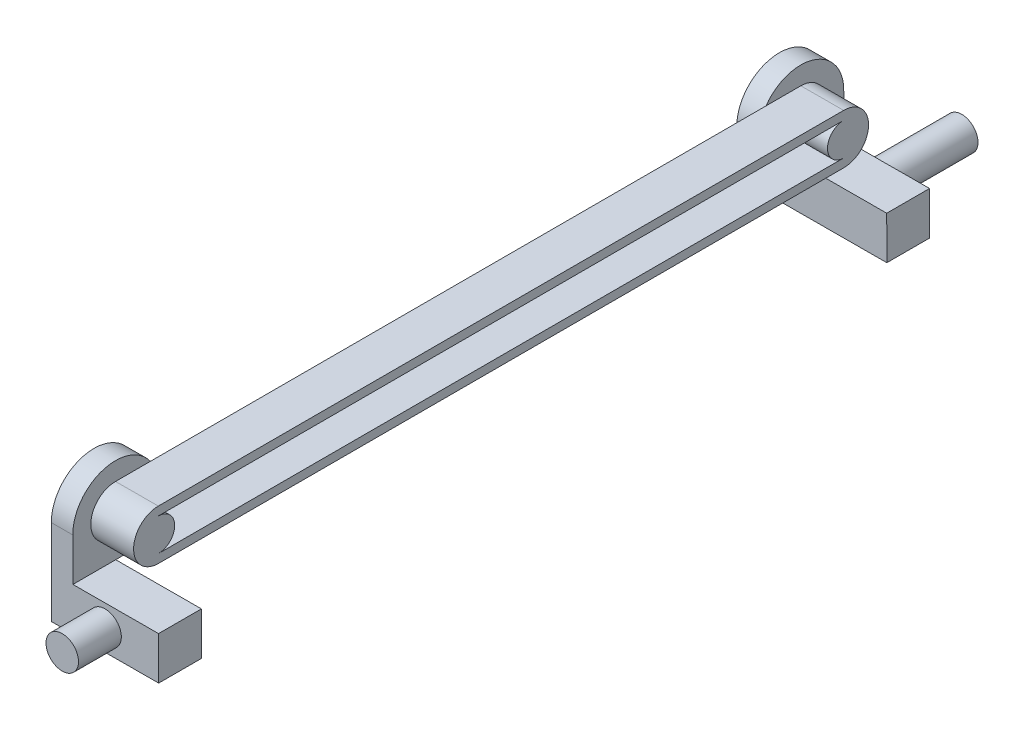
ISO-10303-21;
HEADER;
FILE_DESCRIPTION(('STEP AP214'),'2;1');
FILE_NAME('part.step','',(''),(''),'','','');
FILE_SCHEMA(('AUTOMOTIVE_DESIGN { 1 0 10303 214 1 1 1 1 }'));
ENDSEC;
DATA;
#1=APPLICATION_CONTEXT('core data for automotive mechanical design processes');
#2=APPLICATION_PROTOCOL_DEFINITION('international standard','automotive_design',2000,#1);
#3=PRODUCT_CONTEXT('',#1,'mechanical');
#4=PRODUCT('Part','Part','',(#3));
#5=PRODUCT_RELATED_PRODUCT_CATEGORY('part','',(#4));
#6=PRODUCT_DEFINITION_FORMATION('','',#4);
#7=PRODUCT_DEFINITION_CONTEXT('part definition',#1,'design');
#8=PRODUCT_DEFINITION('design','',#6,#7);
#9=PRODUCT_DEFINITION_SHAPE('','',#8);
#10=(LENGTH_UNIT() NAMED_UNIT(*) SI_UNIT(.MILLI.,.METRE.));
#11=(NAMED_UNIT(*) PLANE_ANGLE_UNIT() SI_UNIT($,.RADIAN.));
#12=(NAMED_UNIT(*) SI_UNIT($,.STERADIAN.) SOLID_ANGLE_UNIT());
#13=UNCERTAINTY_MEASURE_WITH_UNIT(LENGTH_MEASURE(1.E-05),#10,'distance_accuracy_value','');
#14=(GEOMETRIC_REPRESENTATION_CONTEXT(3) GLOBAL_UNCERTAINTY_ASSIGNED_CONTEXT((#13)) GLOBAL_UNIT_ASSIGNED_CONTEXT((#10,
#11,#12)) REPRESENTATION_CONTEXT('',''));
#15=CARTESIAN_POINT('',(0.,0.,0.));
#16=DIRECTION('',(0.,0.,1.));
#17=DIRECTION('',(1.,0.,0.));
#18=AXIS2_PLACEMENT_3D('',#15,#16,#17);
#19=CARTESIAN_POINT('',(342.212888015479,116.84018503398,190.));
#20=DIRECTION('',(0.999994749341557,0.00324056928889778,0.));
#21=DIRECTION('',(-0.00324056928889778,0.999994749341557,0.));
#22=AXIS2_PLACEMENT_3D('',#19,#20,#21);
#23=PLANE('',#22);
#24=DIRECTION('',(0.,0.,-1.));
#25=VECTOR('',#24,1.);
#26=CARTESIAN_POINT('',(342.245293878521,106.84018503398,190.));
#27=LINE('',#26,#25);
#28=CARTESIAN_POINT('',(342.245293878521,106.84018503398,20.));
#29=VERTEX_POINT('',#28);
#30=CARTESIAN_POINT('',(342.245293878521,106.84018503398,10.));
#31=VERTEX_POINT('',#30);
#32=EDGE_CURVE('E256',#29,#31,#27,.T.);
#33=ORIENTED_EDGE('',*,*,#32,.F.);
#34=DIRECTION('',(-0.00324056928889778,0.999994749341557,0.));
#35=VECTOR('',#34,1.);
#36=CARTESIAN_POINT('',(342.212888015479,116.84018503398,20.));
#37=LINE('',#36,#35);
#38=CARTESIAN_POINT('',(342.212888015479,116.84018503398,20.));
#39=VERTEX_POINT('',#38);
#40=EDGE_CURVE('E336',#29,#39,#37,.T.);
#41=ORIENTED_EDGE('',*,*,#40,.T.);
#42=DIRECTION('',(0.,0.,1.));
#43=VECTOR('',#42,1.);
#44=CARTESIAN_POINT('',(342.212888015479,116.84018503398,190.));
#45=LINE('',#44,#43);
#46=CARTESIAN_POINT('',(342.212888015479,116.84018503398,30.));
#47=VERTEX_POINT('',#46);
#48=EDGE_CURVE('E335',#39,#47,#45,.T.);
#49=ORIENTED_EDGE('',*,*,#48,.T.);
#50=DIRECTION('',(-0.00324056928889816,0.999994749341557,0.));
#51=VECTOR('',#50,1.);
#52=CARTESIAN_POINT('',(342.18048232259,126.840132527396,30.));
#53=LINE('',#52,#51);
#54=CARTESIAN_POINT('',(342.18048232259,126.840132527396,30.));
#55=VERTEX_POINT('',#54);
#56=EDGE_CURVE('E268',#47,#55,#53,.T.);
#57=ORIENTED_EDGE('',*,*,#56,.T.);
#58=CARTESIAN_POINT('',(342.18048232259,126.840132527396,20.));
#59=DIRECTION('',(-0.999994749341557,-0.00324056928889778,0.));
#60=DIRECTION('',(-0.00324056928889778,0.999994749341557,0.));
#61=AXIS2_PLACEMENT_3D('',#58,#59,#60);
#62=CIRCLE('',#61,10.);
#63=CARTESIAN_POINT('',(342.18048232259,126.840132527396,10.));
#64=VERTEX_POINT('',#63);
#65=EDGE_CURVE('E271',#55,#64,#62,.T.);
#66=ORIENTED_EDGE('',*,*,#65,.T.);
#67=DIRECTION('',(0.00324056928889778,-0.999994749341557,0.));
#68=VECTOR('',#67,1.);
#69=CARTESIAN_POINT('',(342.212888015479,116.84018503398,10.));
#70=LINE('',#69,#68);
#71=EDGE_CURVE('E288',#64,#31,#70,.T.);
#72=ORIENTED_EDGE('',*,*,#71,.T.);
#73=EDGE_LOOP('',(#33,#41,#49,#57,#66,#72));
#74=FACE_BOUND('',#73,.T.);
#75=ADVANCED_FACE('F34',(#74),#23,.F.);
#76=CARTESIAN_POINT('',(367.245293878521,106.921199691583,190.));
#77=DIRECTION('',(-0.00324056928889667,0.999994749341557,0.));
#78=DIRECTION('',(-0.999994749341557,-0.00324056928889667,0.));
#79=AXIS2_PLACEMENT_3D('',#76,#77,#78);
#80=PLANE('',#79);
#81=CARTESIAN_POINT('',(342.245293878521,106.84018503398,190.));
#82=VERTEX_POINT('',#81);
#83=CARTESIAN_POINT('',(342.245293878521,106.84018503398,180.));
#84=VERTEX_POINT('',#83);
#85=EDGE_CURVE('E257',#82,#84,#27,.T.);
#86=ORIENTED_EDGE('',*,*,#85,.T.);
#87=DIRECTION('',(0.999994749341557,0.00324056928889667,0.));
#88=VECTOR('',#87,1.);
#89=CARTESIAN_POINT('',(367.245293878521,106.921199691583,180.));
#90=LINE('',#89,#88);
#91=CARTESIAN_POINT('',(367.24529387852,106.921199691583,180.));
#92=VERTEX_POINT('',#91);
#93=EDGE_CURVE('E501',#84,#92,#90,.T.);
#94=ORIENTED_EDGE('',*,*,#93,.T.);
#95=DIRECTION('',(0.,0.,-1.));
#96=VECTOR('',#95,1.);
#97=CARTESIAN_POINT('',(367.245293878521,106.921199691583,190.));
#98=LINE('',#97,#96);
#99=CARTESIAN_POINT('',(367.245293878521,106.921199691583,190.));
#100=VERTEX_POINT('',#99);
#101=EDGE_CURVE('E253',#100,#92,#98,.T.);
#102=ORIENTED_EDGE('',*,*,#101,.F.);
#103=DIRECTION('',(0.999994749341557,0.00324056928889667,0.));
#104=VECTOR('',#103,1.);
#105=CARTESIAN_POINT('',(367.245293878521,106.921199691583,190.));
#106=LINE('',#105,#104);
#107=EDGE_CURVE('E292',#82,#100,#106,.T.);
#108=ORIENTED_EDGE('',*,*,#107,.F.);
#109=EDGE_LOOP('',(#86,#94,#102,#108));
#110=FACE_BOUND('',#109,.T.);
#111=ADVANCED_FACE('F505',(#110),#80,.F.);
#112=CARTESIAN_POINT('',(367.212888015479,116.921199691583,190.));
#113=DIRECTION('',(-0.999994749341557,-0.00324056928889778,0.));
#114=DIRECTION('',(0.00324056928889779,-0.999994749341557,0.));
#115=AXIS2_PLACEMENT_3D('',#112,#113,#114);
#116=PLANE('',#115);
#117=ORIENTED_EDGE('',*,*,#101,.T.);
#118=DIRECTION('',(-0.00324056928889667,0.999994749341557,0.));
#119=VECTOR('',#118,1.);
#120=CARTESIAN_POINT('',(367.245556410753,106.840185884738,180.));
#121=LINE('',#120,#119);
#122=CARTESIAN_POINT('',(367.212888015479,116.921199691583,180.));
#123=VERTEX_POINT('',#122);
#124=EDGE_CURVE('E224',#92,#123,#121,.T.);
#125=ORIENTED_EDGE('',*,*,#124,.T.);
#126=DIRECTION('',(0.,0.,-1.));
#127=VECTOR('',#126,1.);
#128=CARTESIAN_POINT('',(367.212888015479,116.921199691583,190.));
#129=LINE('',#128,#127);
#130=CARTESIAN_POINT('',(367.212888015479,116.921199691583,190.));
#131=VERTEX_POINT('',#130);
#132=EDGE_CURVE('E241',#131,#123,#129,.T.);
#133=ORIENTED_EDGE('',*,*,#132,.F.);
#134=DIRECTION('',(-0.00324056928889779,0.999994749341557,0.));
#135=VECTOR('',#134,1.);
#136=CARTESIAN_POINT('',(367.212888015479,116.921199691583,190.));
#137=LINE('',#136,#135);
#138=EDGE_CURVE('E247',#100,#131,#137,.T.);
#139=ORIENTED_EDGE('',*,*,#138,.F.);
#140=EDGE_LOOP('',(#117,#125,#133,#139));
#141=FACE_BOUND('',#140,.T.);
#142=ADVANCED_FACE('F509',(#141),#116,.F.);
#143=CARTESIAN_POINT('',(367.212888015479,116.921199691583,190.));
#144=DIRECTION('',(0.00324056928889611,-0.999994749341557,0.));
#145=DIRECTION('',(0.999994749341557,0.00324056928889611,0.));
#146=AXIS2_PLACEMENT_3D('',#143,#144,#145);
#147=PLANE('',#146);
#148=ORIENTED_EDGE('',*,*,#132,.T.);
#149=DIRECTION('',(0.999994749341557,0.00324056928889664,0.));
#150=VECTOR('',#149,1.);
#151=CARTESIAN_POINT('',(-112.488455532832,115.366686087618,180.));
#152=LINE('',#151,#150);
#153=CARTESIAN_POINT('',(347.212861762187,116.856387880425,180.));
#154=VERTEX_POINT('',#153);
#155=EDGE_CURVE('E234',#154,#123,#152,.T.);
#156=ORIENTED_EDGE('',*,*,#155,.F.);
#157=DIRECTION('',(0.,0.,-1.));
#158=VECTOR('',#157,1.);
#159=CARTESIAN_POINT('',(347.212861762187,116.856387880425,170.));
#160=LINE('',#159,#158);
#161=CARTESIAN_POINT('',(347.212861762187,116.856387880425,190.));
#162=VERTEX_POINT('',#161);
#163=EDGE_CURVE('E372',#162,#154,#160,.T.);
#164=ORIENTED_EDGE('',*,*,#163,.F.);
#165=DIRECTION('',(-0.999994749341557,-0.00324056928889611,0.));
#166=VECTOR('',#165,1.);
#167=CARTESIAN_POINT('',(367.212888015479,116.921199691583,190.));
#168=LINE('',#167,#166);
#169=EDGE_CURVE('E242',#131,#162,#168,.T.);
#170=ORIENTED_EDGE('',*,*,#169,.F.);
#171=EDGE_LOOP('',(#148,#156,#164,#170));
#172=FACE_BOUND('',#171,.T.);
#173=ADVANCED_FACE('F370',(#172),#147,.F.);
#174=CARTESIAN_POINT('',(347.180456069298,126.85633537384,20.));
#175=DIRECTION('',(0.999994749341557,0.00324056928889778,0.));
#176=DIRECTION('',(-0.00324056928889778,0.999994749341557,0.));
#177=AXIS2_PLACEMENT_3D('',#174,#175,#176);
#178=PLANE('',#177);
#179=CARTESIAN_POINT('',(347.180456069298,126.85633537384,20.));
#180=DIRECTION('',(0.999994749341557,0.00324056928889778,0.));
#181=DIRECTION('',(-0.00324056928889778,0.999994749341557,0.));
#182=AXIS2_PLACEMENT_3D('',#179,#180,#181);
#183=CIRCLE('',#182,5.79499999999387);
#184=CARTESIAN_POINT('',(347.199235168327,121.061365801412,20.));
#185=VERTEX_POINT('',#184);
#186=CARTESIAN_POINT('',(347.161676970269,132.651304946267,20.));
#187=VERTEX_POINT('',#186);
#188=EDGE_CURVE('E51',#185,#187,#183,.T.);
#189=ORIENTED_EDGE('',*,*,#188,.F.);
#190=DIRECTION('',(0.,0.,-1.));
#191=VECTOR('',#190,1.);
#192=CARTESIAN_POINT('',(347.199235168327,121.061365801411,20.));
#193=LINE('',#192,#191);
#194=CARTESIAN_POINT('',(347.199235168327,121.061365801411,30.));
#195=VERTEX_POINT('',#194);
#196=EDGE_CURVE('E444',#195,#185,#193,.T.);
#197=ORIENTED_EDGE('',*,*,#196,.F.);
#198=DIRECTION('',(-0.00324056928889816,0.999994749341557,0.));
#199=VECTOR('',#198,1.);
#200=CARTESIAN_POINT('',(347.180456069298,126.85633537384,30.));
#201=LINE('',#200,#199);
#202=CARTESIAN_POINT('',(347.212861762187,116.856387880425,30.));
#203=VERTEX_POINT('',#202);
#204=EDGE_CURVE('E319',#203,#195,#201,.T.);
#205=ORIENTED_EDGE('',*,*,#204,.F.);
#206=DIRECTION('',(0.,0.,1.));
#207=VECTOR('',#206,1.);
#208=CARTESIAN_POINT('',(347.212861762187,116.856387880425,20.));
#209=LINE('',#208,#207);
#210=CARTESIAN_POINT('',(347.212861762187,116.856387880425,20.));
#211=VERTEX_POINT('',#210);
#212=EDGE_CURVE('E338',#211,#203,#209,.T.);
#213=ORIENTED_EDGE('',*,*,#212,.F.);
#214=DIRECTION('',(0.,0.,1.));
#215=VECTOR('',#214,1.);
#216=CARTESIAN_POINT('',(347.212861762187,116.856387880425,30.));
#217=LINE('',#216,#215);
#218=CARTESIAN_POINT('',(347.212861762187,116.856387880425,10.));
#219=VERTEX_POINT('',#218);
#220=EDGE_CURVE('E233',#219,#211,#217,.T.);
#221=ORIENTED_EDGE('',*,*,#220,.F.);
#222=DIRECTION('',(0.00324056928889816,-0.999994749341557,0.));
#223=VECTOR('',#222,1.);
#224=CARTESIAN_POINT('',(347.212861762187,116.856387880425,10.));
#225=LINE('',#224,#223);
#226=CARTESIAN_POINT('',(347.180456069298,126.85633537384,10.));
#227=VERTEX_POINT('',#226);
#228=EDGE_CURVE('E279',#227,#219,#225,.T.);
#229=ORIENTED_EDGE('',*,*,#228,.F.);
#230=CARTESIAN_POINT('',(347.180456069298,126.85633537384,20.));
#231=DIRECTION('',(-0.999994749341557,-0.00324056928889778,0.));
#232=DIRECTION('',(-0.00324056928889778,0.999994749341557,0.));
#233=AXIS2_PLACEMENT_3D('',#230,#231,#232);
#234=CIRCLE('',#233,10.);
#235=CARTESIAN_POINT('',(347.161676970269,132.651304946267,28.1497223879149));
#236=VERTEX_POINT('',#235);
#237=EDGE_CURVE('E311',#236,#227,#234,.T.);
#238=ORIENTED_EDGE('',*,*,#237,.F.);
#239=DIRECTION('',(0.,0.,1.));
#240=VECTOR('',#239,1.);
#241=CARTESIAN_POINT('',(347.161676970269,132.651304946267,180.));
#242=LINE('',#241,#240);
#243=EDGE_CURVE('E56',#187,#236,#242,.T.);
#244=ORIENTED_EDGE('',*,*,#243,.F.);
#245=EDGE_LOOP('',(#189,#197,#205,#213,#221,#229,#238,#244));
#246=FACE_BOUND('',#245,.T.);
#247=ADVANCED_FACE('F565',(#246),#178,.T.);
#248=CARTESIAN_POINT('',(357.180403562714,126.888741066729,20.));
#249=DIRECTION('',(-0.999994749341557,-0.00324056928889778,0.));
#250=DIRECTION('',(0.00324056928889778,-0.999994749341557,0.));
#251=AXIS2_PLACEMENT_3D('',#248,#249,#250);
#252=CYLINDRICAL_SURFACE('',#251,3.79499999999475);
#253=CARTESIAN_POINT('',(347.180456069298,126.85633537384,20.));
#254=DIRECTION('',(0.999994749341557,0.00324056928889778,0.));
#255=DIRECTION('',(-0.00324056928889778,0.999994749341557,0.));
#256=AXIS2_PLACEMENT_3D('',#253,#254,#255);
#257=CIRCLE('',#256,3.79499999999475);
#258=CARTESIAN_POINT('',(347.168158108847,130.651315447585,20.));
#259=VERTEX_POINT('',#258);
#260=CARTESIAN_POINT('',(347.19275402975,123.061355300094,20.));
#261=VERTEX_POINT('',#260);
#262=EDGE_CURVE('E272',#259,#261,#257,.T.);
#263=ORIENTED_EDGE('',*,*,#262,.T.);
#264=DIRECTION('',(-0.999994749341557,-0.00324056928889778,0.));
#265=VECTOR('',#264,1.);
#266=CARTESIAN_POINT('',(357.192701523165,123.093760992984,20.));
#267=LINE('',#266,#265);
#268=CARTESIAN_POINT('',(357.192701523165,123.093760992984,20.));
#269=VERTEX_POINT('',#268);
#270=EDGE_CURVE('E409',#269,#261,#267,.T.);
#271=ORIENTED_EDGE('',*,*,#270,.F.);
#272=CARTESIAN_POINT('',(357.180403562714,126.888741066729,20.));
#273=DIRECTION('',(-0.999994749341557,-0.00324056928889763,0.));
#274=DIRECTION('',(0.00324056928889763,-0.999994749341557,0.));
#275=AXIS2_PLACEMENT_3D('',#272,#273,#274);
#276=CIRCLE('',#275,3.79499999999475);
#277=CARTESIAN_POINT('',(357.168105602263,130.683721140473,20.));
#278=VERTEX_POINT('',#277);
#279=EDGE_CURVE('E397',#269,#278,#276,.T.);
#280=ORIENTED_EDGE('',*,*,#279,.T.);
#281=DIRECTION('',(-0.999994749341557,-0.00324056928889778,0.));
#282=VECTOR('',#281,1.);
#283=CARTESIAN_POINT('',(357.168105602263,130.683721140473,20.));
#284=LINE('',#283,#282);
#285=EDGE_CURVE('E412',#278,#259,#284,.T.);
#286=ORIENTED_EDGE('',*,*,#285,.T.);
#287=EDGE_LOOP('',(#263,#271,#280,#286));
#288=FACE_BOUND('',#287,.T.);
#289=ADVANCED_FACE('F408',(#288),#252,.T.);
#290=CARTESIAN_POINT('',(347.180456069298,126.85633537384,180.));
#291=DIRECTION('',(0.999994749341557,0.00324056928889778,0.));
#292=DIRECTION('',(-0.00324056928889778,0.999994749341557,0.));
#293=AXIS2_PLACEMENT_3D('',#290,#291,#292);
#294=PLANE('',#293);
#295=DIRECTION('',(-0.00324056928889816,0.999994749341557,0.));
#296=VECTOR('',#295,1.);
#297=CARTESIAN_POINT('',(347.180456069298,126.85633537384,170.));
#298=LINE('',#297,#296);
#299=CARTESIAN_POINT('',(347.212861762187,116.856387880425,170.));
#300=VERTEX_POINT('',#299);
#301=CARTESIAN_POINT('',(347.199235168327,121.061365801411,170.));
#302=VERTEX_POINT('',#301);
#303=EDGE_CURVE('E391',#300,#302,#298,.T.);
#304=ORIENTED_EDGE('',*,*,#303,.T.);
#305=CARTESIAN_POINT('',(347.199235168327,121.061365801411,180.));
#306=VERTEX_POINT('',#305);
#307=EDGE_CURVE('E445',#306,#302,#193,.T.);
#308=ORIENTED_EDGE('',*,*,#307,.F.);
#309=CARTESIAN_POINT('',(347.180456069298,126.85633537384,180.));
#310=DIRECTION('',(0.999994749341557,0.00324056928889778,0.));
#311=DIRECTION('',(-0.00324056928889778,0.999994749341557,0.));
#312=AXIS2_PLACEMENT_3D('',#309,#310,#311);
#313=CIRCLE('',#312,5.79499999999386);
#314=CARTESIAN_POINT('',(347.161676970269,132.651304946267,180.));
#315=VERTEX_POINT('',#314);
#316=EDGE_CURVE('E426',#315,#306,#313,.T.);
#317=ORIENTED_EDGE('',*,*,#316,.F.);
#318=CARTESIAN_POINT('',(347.161676970269,132.651304946267,171.850277612085));
#319=VERTEX_POINT('',#318);
#320=EDGE_CURVE('E450',#319,#315,#242,.T.);
#321=ORIENTED_EDGE('',*,*,#320,.F.);
#322=CARTESIAN_POINT('',(347.180456069298,126.85633537384,180.));
#323=DIRECTION('',(0.999994749341557,0.00324056928889778,0.));
#324=DIRECTION('',(-0.00324056928889778,0.999994749341557,0.));
#325=AXIS2_PLACEMENT_3D('',#322,#323,#324);
#326=CIRCLE('',#325,10.);
#327=CARTESIAN_POINT('',(347.180456069298,126.85633537384,190.));
#328=VERTEX_POINT('',#327);
#329=EDGE_CURVE('E379',#319,#328,#326,.T.);
#330=ORIENTED_EDGE('',*,*,#329,.T.);
#331=DIRECTION('',(0.00324056928889816,-0.999994749341557,0.));
#332=VECTOR('',#331,1.);
#333=CARTESIAN_POINT('',(347.212861762187,116.856387880425,190.));
#334=LINE('',#333,#332);
#335=EDGE_CURVE('E376',#328,#162,#334,.T.);
#336=ORIENTED_EDGE('',*,*,#335,.T.);
#337=ORIENTED_EDGE('',*,*,#163,.T.);
#338=DIRECTION('',(0.,0.,1.));
#339=VECTOR('',#338,1.);
#340=CARTESIAN_POINT('',(347.212861762187,116.856387880425,180.));
#341=LINE('',#340,#339);
#342=EDGE_CURVE('E341',#300,#154,#341,.T.);
#343=ORIENTED_EDGE('',*,*,#342,.F.);
#344=EDGE_LOOP('',(#304,#308,#317,#321,#330,#336,#337,#343));
#345=FACE_BOUND('',#344,.T.);
#346=ADVANCED_FACE('F374',(#345),#294,.T.);
#347=CARTESIAN_POINT('',(354.729090947,111.880692362781,10.));
#348=DIRECTION('',(0.,0.,-1.));
#349=DIRECTION('',(-1.,0.,0.));
#350=AXIS2_PLACEMENT_3D('',#347,#348,#349);
#351=CYLINDRICAL_SURFACE('',#350,3.79500000000001);
#352=CARTESIAN_POINT('',(354.729090947,111.880692362781,10.));
#353=DIRECTION('',(0.,0.,1.));
#354=DIRECTION('',(1.,0.,0.));
#355=AXIS2_PLACEMENT_3D('',#352,#353,#354);
#356=CIRCLE('',#355,3.79500000000001);
#357=CARTESIAN_POINT('',(358.524090947,111.880692362781,10.));
#358=VERTEX_POINT('',#357);
#359=EDGE_CURVE('E43',#358,#358,#356,.T.);
#360=ORIENTED_EDGE('',*,*,#359,.F.);
#361=EDGE_LOOP('',(#360));
#362=FACE_BOUND('',#361,.T.);
#363=CARTESIAN_POINT('',(354.729090947,111.880692362781,-10.));
#364=DIRECTION('',(0.,0.,1.));
#365=DIRECTION('',(1.,0.,0.));
#366=AXIS2_PLACEMENT_3D('',#363,#364,#365);
#367=CIRCLE('',#366,3.79500000000001);
#368=CARTESIAN_POINT('',(358.524090947,111.880692362781,-10.));
#369=VERTEX_POINT('',#368);
#370=EDGE_CURVE('E260',#369,#369,#367,.T.);
#371=ORIENTED_EDGE('',*,*,#370,.T.);
#372=EDGE_LOOP('',(#371));
#373=FACE_BOUND('',#372,.T.);
#374=ADVANCED_FACE('F36',(#362,#373),#351,.T.);
#375=CARTESIAN_POINT('',(354.729090947,111.880692362781,-10.));
#376=DIRECTION('',(0.,0.,1.));
#377=DIRECTION('',(1.,0.,0.));
#378=AXIS2_PLACEMENT_3D('',#375,#376,#377);
#379=PLANE('',#378);
#380=ORIENTED_EDGE('',*,*,#370,.F.);
#381=EDGE_LOOP('',(#380));
#382=FACE_BOUND('',#381,.T.);
#383=ADVANCED_FACE('F575',(#382),#379,.F.);
#384=CARTESIAN_POINT('',(342.212888015479,116.84018503398,170.));
#385=VERTEX_POINT('',#384);
#386=CARTESIAN_POINT('',(342.212888015479,116.84018503398,180.));
#387=VERTEX_POINT('',#386);
#388=EDGE_CURVE('E346',#385,#387,#45,.T.);
#389=ORIENTED_EDGE('',*,*,#388,.T.);
#390=DIRECTION('',(0.00324056928889778,-0.999994749341557,0.));
#391=VECTOR('',#390,1.);
#392=CARTESIAN_POINT('',(342.212888015479,116.84018503398,180.));
#393=LINE('',#392,#391);
#394=EDGE_CURVE('E366',#387,#84,#393,.T.);
#395=ORIENTED_EDGE('',*,*,#394,.T.);
#396=ORIENTED_EDGE('',*,*,#85,.F.);
#397=DIRECTION('',(0.00324056928889778,-0.999994749341557,0.));
#398=VECTOR('',#397,1.);
#399=CARTESIAN_POINT('',(342.212888015479,116.84018503398,190.));
#400=LINE('',#399,#398);
#401=CARTESIAN_POINT('',(342.18048232259,126.840132527396,190.));
#402=VERTEX_POINT('',#401);
#403=EDGE_CURVE('E267',#402,#82,#400,.T.);
#404=ORIENTED_EDGE('',*,*,#403,.F.);
#405=CARTESIAN_POINT('',(342.18048232259,126.840132527396,180.));
#406=DIRECTION('',(0.999994749341557,0.00324056928889778,0.));
#407=DIRECTION('',(-0.00324056928889778,0.999994749341557,0.));
#408=AXIS2_PLACEMENT_3D('',#405,#406,#407);
#409=CIRCLE('',#408,10.);
#410=CARTESIAN_POINT('',(342.18048232259,126.840132527396,170.));
#411=VERTEX_POINT('',#410);
#412=EDGE_CURVE('E381',#411,#402,#409,.T.);
#413=ORIENTED_EDGE('',*,*,#412,.F.);
#414=DIRECTION('',(-0.00324056928889816,0.999994749341557,0.));
#415=VECTOR('',#414,1.);
#416=CARTESIAN_POINT('',(342.18048232259,126.840132527396,170.));
#417=LINE('',#416,#415);
#418=EDGE_CURVE('E377',#385,#411,#417,.T.);
#419=ORIENTED_EDGE('',*,*,#418,.F.);
#420=EDGE_LOOP('',(#389,#395,#396,#404,#413,#419));
#421=FACE_BOUND('',#420,.T.);
#422=ADVANCED_FACE('F515',(#421),#23,.F.);
#423=CARTESIAN_POINT('',(367.24529387852,106.921199691583,20.));
#424=VERTEX_POINT('',#423);
#425=CARTESIAN_POINT('',(367.245293878521,106.921199691583,10.));
#426=VERTEX_POINT('',#425);
#427=EDGE_CURVE('E245',#424,#426,#98,.T.);
#428=ORIENTED_EDGE('',*,*,#427,.F.);
#429=DIRECTION('',(-0.999994749341557,-0.00324056928889667,0.));
#430=VECTOR('',#429,1.);
#431=CARTESIAN_POINT('',(367.245293878521,106.921199691583,20.));
#432=LINE('',#431,#430);
#433=EDGE_CURVE('E220',#424,#29,#432,.T.);
#434=ORIENTED_EDGE('',*,*,#433,.T.);
#435=ORIENTED_EDGE('',*,*,#32,.T.);
#436=DIRECTION('',(0.999994749341557,0.00324056928889667,0.));
#437=VECTOR('',#436,1.);
#438=CARTESIAN_POINT('',(367.245293878521,106.921199691583,10.));
#439=LINE('',#438,#437);
#440=EDGE_CURVE('E297',#31,#426,#439,.T.);
#441=ORIENTED_EDGE('',*,*,#440,.T.);
#442=EDGE_LOOP('',(#428,#434,#435,#441));
#443=FACE_BOUND('',#442,.T.);
#444=ADVANCED_FACE('F301',(#443),#80,.F.);
#445=CARTESIAN_POINT('',(367.212888015479,116.921199691583,20.));
#446=VERTEX_POINT('',#445);
#447=CARTESIAN_POINT('',(367.212888015479,116.921199691583,10.));
#448=VERTEX_POINT('',#447);
#449=EDGE_CURVE('E231',#446,#448,#129,.T.);
#450=ORIENTED_EDGE('',*,*,#449,.F.);
#451=DIRECTION('',(-0.00324056928889667,0.999994749341557,0.));
#452=VECTOR('',#451,1.);
#453=CARTESIAN_POINT('',(367.245556410753,106.840185884738,20.));
#454=LINE('',#453,#452);
#455=EDGE_CURVE('E213',#424,#446,#454,.T.);
#456=ORIENTED_EDGE('',*,*,#455,.F.);
#457=ORIENTED_EDGE('',*,*,#427,.T.);
#458=DIRECTION('',(-0.00324056928889779,0.999994749341557,0.));
#459=VECTOR('',#458,1.);
#460=CARTESIAN_POINT('',(367.212888015479,116.921199691583,10.));
#461=LINE('',#460,#459);
#462=EDGE_CURVE('E239',#426,#448,#461,.T.);
#463=ORIENTED_EDGE('',*,*,#462,.T.);
#464=EDGE_LOOP('',(#450,#456,#457,#463));
#465=FACE_BOUND('',#464,.T.);
#466=ADVANCED_FACE('F237',(#465),#116,.F.);
#467=ORIENTED_EDGE('',*,*,#220,.T.);
#468=DIRECTION('',(-0.999994749341557,-0.00324056928889664,0.));
#469=VECTOR('',#468,1.);
#470=CARTESIAN_POINT('',(367.212888015479,116.921199691583,20.));
#471=LINE('',#470,#469);
#472=EDGE_CURVE('E217',#446,#211,#471,.T.);
#473=ORIENTED_EDGE('',*,*,#472,.F.);
#474=ORIENTED_EDGE('',*,*,#449,.T.);
#475=DIRECTION('',(-0.999994749341557,-0.00324056928889611,0.));
#476=VECTOR('',#475,1.);
#477=CARTESIAN_POINT('',(367.212888015479,116.921199691583,10.));
#478=LINE('',#477,#476);
#479=EDGE_CURVE('E265',#448,#219,#478,.T.);
#480=ORIENTED_EDGE('',*,*,#479,.T.);
#481=EDGE_LOOP('',(#467,#473,#474,#480));
#482=FACE_BOUND('',#481,.T.);
#483=ADVANCED_FACE('F229',(#482),#147,.F.);
#484=CARTESIAN_POINT('',(0.,0.,190.));
#485=DIRECTION('',(0.,0.,-1.));
#486=DIRECTION('',(-1.,0.,0.));
#487=AXIS2_PLACEMENT_3D('',#484,#485,#486);
#488=PLANE('',#487);
#489=CARTESIAN_POINT('',(354.729090947,111.880692362781,190.));
#490=DIRECTION('',(0.,0.,-1.));
#491=DIRECTION('',(-1.,0.,0.));
#492=AXIS2_PLACEMENT_3D('',#489,#490,#491);
#493=CIRCLE('',#492,3.79500000000001);
#494=CARTESIAN_POINT('',(350.934090947,111.880692362781,190.));
#495=VERTEX_POINT('',#494);
#496=EDGE_CURVE('E11',#495,#495,#493,.F.);
#497=ORIENTED_EDGE('',*,*,#496,.F.);
#498=EDGE_LOOP('',(#497));
#499=FACE_BOUND('',#498,.T.);
#500=ORIENTED_EDGE('',*,*,#403,.T.);
#501=ORIENTED_EDGE('',*,*,#107,.T.);
#502=ORIENTED_EDGE('',*,*,#138,.T.);
#503=ORIENTED_EDGE('',*,*,#169,.T.);
#504=ORIENTED_EDGE('',*,*,#335,.F.);
#505=DIRECTION('',(-0.999994749341557,-0.00324056928889778,0.));
#506=VECTOR('',#505,1.);
#507=CARTESIAN_POINT('',(347.180456069298,126.85633537384,190.));
#508=LINE('',#507,#506);
#509=EDGE_CURVE('E393',#328,#402,#508,.T.);
#510=ORIENTED_EDGE('',*,*,#509,.T.);
#511=EDGE_LOOP('',(#500,#501,#502,#503,#504,#510));
#512=FACE_BOUND('',#511,.T.);
#513=ADVANCED_FACE('F511',(#499,#512),#488,.F.);
#514=CARTESIAN_POINT('',(0.,0.,10.));
#515=DIRECTION('',(0.,0.,-1.));
#516=DIRECTION('',(-1.,0.,0.));
#517=AXIS2_PLACEMENT_3D('',#514,#515,#516);
#518=PLANE('',#517);
#519=ORIENTED_EDGE('',*,*,#359,.T.);
#520=EDGE_LOOP('',(#519));
#521=FACE_BOUND('',#520,.T.);
#522=ORIENTED_EDGE('',*,*,#71,.F.);
#523=DIRECTION('',(-0.999994749341557,-0.00324056928889778,0.));
#524=VECTOR('',#523,1.);
#525=CARTESIAN_POINT('',(347.180456069298,126.85633537384,10.));
#526=LINE('',#525,#524);
#527=EDGE_CURVE('E289',#227,#64,#526,.T.);
#528=ORIENTED_EDGE('',*,*,#527,.F.);
#529=ORIENTED_EDGE('',*,*,#228,.T.);
#530=ORIENTED_EDGE('',*,*,#479,.F.);
#531=ORIENTED_EDGE('',*,*,#462,.F.);
#532=ORIENTED_EDGE('',*,*,#440,.F.);
#533=EDGE_LOOP('',(#522,#528,#529,#530,#531,#532));
#534=FACE_BOUND('',#533,.T.);
#535=ADVANCED_FACE('F304',(#521,#534),#518,.T.);
#536=CARTESIAN_POINT('',(354.729090947,111.880692362781,200.));
#537=DIRECTION('',(0.,0.,-1.));
#538=DIRECTION('',(-1.,0.,0.));
#539=AXIS2_PLACEMENT_3D('',#536,#537,#538);
#540=CYLINDRICAL_SURFACE('',#539,3.79500000000001);
#541=CARTESIAN_POINT('',(354.729090947,111.880692362781,200.));
#542=DIRECTION('',(0.,0.,1.));
#543=DIRECTION('',(1.,0.,0.));
#544=AXIS2_PLACEMENT_3D('',#541,#542,#543);
#545=CIRCLE('',#544,3.79500000000001);
#546=CARTESIAN_POINT('',(358.524090947,111.880692362781,200.));
#547=VERTEX_POINT('',#546);
#548=EDGE_CURVE('E285',#547,#547,#545,.T.);
#549=ORIENTED_EDGE('',*,*,#548,.F.);
#550=EDGE_LOOP('',(#549));
#551=FACE_BOUND('',#550,.T.);
#552=ORIENTED_EDGE('',*,*,#496,.T.);
#553=EDGE_LOOP('',(#552));
#554=FACE_BOUND('',#553,.T.);
#555=ADVANCED_FACE('F593',(#551,#554),#540,.T.);
#556=CARTESIAN_POINT('',(354.729090947,111.880692362781,200.));
#557=DIRECTION('',(0.,0.,1.));
#558=DIRECTION('',(1.,0.,0.));
#559=AXIS2_PLACEMENT_3D('',#556,#557,#558);
#560=PLANE('',#559);
#561=ORIENTED_EDGE('',*,*,#548,.T.);
#562=EDGE_LOOP('',(#561));
#563=FACE_BOUND('',#562,.T.);
#564=ADVANCED_FACE('F599',(#563),#560,.T.);
#565=CARTESIAN_POINT('',(347.180456069298,126.85633537384,20.));
#566=DIRECTION('',(-0.999994749341557,-0.00324056928889778,0.));
#567=DIRECTION('',(0.00324056928889778,-0.999994749341557,0.));
#568=AXIS2_PLACEMENT_3D('',#565,#566,#567);
#569=CYLINDRICAL_SURFACE('',#568,10.);
#570=ORIENTED_EDGE('',*,*,#65,.F.);
#571=DIRECTION('',(-0.999994749341557,-0.00324056928889778,0.));
#572=VECTOR('',#571,1.);
#573=CARTESIAN_POINT('',(347.180456069298,126.85633537384,30.));
#574=LINE('',#573,#572);
#575=CARTESIAN_POINT('',(347.180456069298,126.85633537384,30.));
#576=VERTEX_POINT('',#575);
#577=EDGE_CURVE('E278',#576,#55,#574,.T.);
#578=ORIENTED_EDGE('',*,*,#577,.F.);
#579=CARTESIAN_POINT('',(347.168158108847,130.651315447584,29.2519173688513));
#580=VERTEX_POINT('',#579);
#581=EDGE_CURVE('E309',#576,#580,#234,.T.);
#582=ORIENTED_EDGE('',*,*,#581,.T.);
#583=CARTESIAN_POINT('',(347.180456069298,126.85633537384,20.));
#584=DIRECTION('',(0.999994749341557,0.00324056928889778,0.));
#585=DIRECTION('',(-0.00324056928889778,0.999994749341557,0.));
#586=AXIS2_PLACEMENT_3D('',#583,#584,#585);
#587=CIRCLE('',#586,10.);
#588=EDGE_CURVE('E469',#580,#236,#587,.F.);
#589=ORIENTED_EDGE('',*,*,#588,.T.);
#590=ORIENTED_EDGE('',*,*,#237,.T.);
#591=ORIENTED_EDGE('',*,*,#527,.T.);
#592=EDGE_LOOP('',(#570,#578,#582,#589,#590,#591));
#593=FACE_BOUND('',#592,.T.);
#594=ADVANCED_FACE('F331',(#593),#569,.T.);
#595=CARTESIAN_POINT('',(347.180456069298,126.85633537384,30.));
#596=DIRECTION('',(0.,0.,1.));
#597=DIRECTION('',(1.,0.,0.));
#598=AXIS2_PLACEMENT_3D('',#595,#596,#597);
#599=PLANE('',#598);
#600=ORIENTED_EDGE('',*,*,#56,.F.);
#601=DIRECTION('',(-0.999994749341557,-0.00324056928889778,0.));
#602=VECTOR('',#601,1.);
#603=CARTESIAN_POINT('',(347.212861762187,116.856387880425,30.));
#604=LINE('',#603,#602);
#605=EDGE_CURVE('E275',#203,#47,#604,.T.);
#606=ORIENTED_EDGE('',*,*,#605,.F.);
#607=ORIENTED_EDGE('',*,*,#204,.T.);
#608=DIRECTION('',(-0.00324056928889778,0.999994749341557,0.));
#609=VECTOR('',#608,1.);
#610=CARTESIAN_POINT('',(347.180456069298,126.85633537384,30.));
#611=LINE('',#610,#609);
#612=CARTESIAN_POINT('',(347.19275402975,123.061355300094,30.));
#613=VERTEX_POINT('',#612);
#614=EDGE_CURVE('E467',#195,#613,#611,.T.);
#615=ORIENTED_EDGE('',*,*,#614,.T.);
#616=EDGE_CURVE('E330',#613,#576,#201,.T.);
#617=ORIENTED_EDGE('',*,*,#616,.T.);
#618=ORIENTED_EDGE('',*,*,#577,.T.);
#619=EDGE_LOOP('',(#600,#606,#607,#615,#617,#618));
#620=FACE_BOUND('',#619,.T.);
#621=ADVANCED_FACE('F327',(#620),#599,.T.);
#622=DIRECTION('',(0.,0.,-1.));
#623=VECTOR('',#622,1.);
#624=CARTESIAN_POINT('',(347.19275402975,123.061355300094,20.));
#625=LINE('',#624,#623);
#626=EDGE_CURVE('E419',#613,#261,#625,.T.);
#627=ORIENTED_EDGE('',*,*,#626,.T.);
#628=ORIENTED_EDGE('',*,*,#262,.F.);
#629=DIRECTION('',(0.,0.,1.));
#630=VECTOR('',#629,1.);
#631=CARTESIAN_POINT('',(347.168158108847,130.651315447584,180.));
#632=LINE('',#631,#630);
#633=EDGE_CURVE('E493',#259,#580,#632,.T.);
#634=ORIENTED_EDGE('',*,*,#633,.T.);
#635=ORIENTED_EDGE('',*,*,#581,.F.);
#636=ORIENTED_EDGE('',*,*,#616,.F.);
#637=EDGE_LOOP('',(#627,#628,#634,#635,#636));
#638=FACE_BOUND('',#637,.T.);
#639=ADVANCED_FACE('F549',(#638),#178,.T.);
#640=CARTESIAN_POINT('',(357.587842306338,1.15879426429398,0.));
#641=DIRECTION('',(-0.999994749341557,-0.00324056928889763,0.));
#642=DIRECTION('',(0.00324056928889763,-0.999994749341557,0.));
#643=AXIS2_PLACEMENT_3D('',#640,#641,#642);
#644=PLANE('',#643);
#645=ORIENTED_EDGE('',*,*,#279,.F.);
#646=DIRECTION('',(0.,0.,-1.));
#647=VECTOR('',#646,1.);
#648=CARTESIAN_POINT('',(357.192701523165,123.093760992983,20.));
#649=LINE('',#648,#647);
#650=CARTESIAN_POINT('',(357.192701523165,123.093760992983,180.));
#651=VERTEX_POINT('',#650);
#652=EDGE_CURVE('E422',#651,#269,#649,.T.);
#653=ORIENTED_EDGE('',*,*,#652,.F.);
#654=CARTESIAN_POINT('',(357.180403562714,126.888741066729,180.));
#655=DIRECTION('',(0.999994749341557,0.00324056928889763,0.));
#656=DIRECTION('',(0.00324056928889763,-0.999994749341557,0.));
#657=AXIS2_PLACEMENT_3D('',#654,#655,#656);
#658=CIRCLE('',#657,3.79499999999475);
#659=CARTESIAN_POINT('',(357.168105602263,130.683721140473,180.));
#660=VERTEX_POINT('',#659);
#661=EDGE_CURVE('E470',#651,#660,#658,.T.);
#662=ORIENTED_EDGE('',*,*,#661,.T.);
#663=DIRECTION('',(0.,0.,1.));
#664=VECTOR('',#663,1.);
#665=CARTESIAN_POINT('',(357.168105602263,130.683721140473,180.));
#666=LINE('',#665,#664);
#667=EDGE_CURVE('E496',#278,#660,#666,.T.);
#668=ORIENTED_EDGE('',*,*,#667,.F.);
#669=EDGE_LOOP('',(#645,#653,#662,#668));
#670=FACE_BOUND('',#669,.T.);
#671=CARTESIAN_POINT('',(357.180403562714,126.888741066729,180.));
#672=DIRECTION('',(0.999994749341557,0.00324056928889778,0.));
#673=DIRECTION('',(-0.00324056928889778,0.999994749341557,0.));
#674=AXIS2_PLACEMENT_3D('',#671,#672,#673);
#675=CIRCLE('',#674,5.79499999999386);
#676=CARTESIAN_POINT('',(357.161624463685,132.683710639156,180.));
#677=VERTEX_POINT('',#676);
#678=CARTESIAN_POINT('',(357.199182661743,121.0937714943,180.));
#679=VERTEX_POINT('',#678);
#680=EDGE_CURVE('E432',#677,#679,#675,.T.);
#681=ORIENTED_EDGE('',*,*,#680,.T.);
#682=DIRECTION('',(0.,0.,-1.));
#683=VECTOR('',#682,1.);
#684=CARTESIAN_POINT('',(357.199182661743,121.0937714943,20.));
#685=LINE('',#684,#683);
#686=CARTESIAN_POINT('',(357.199182661743,121.093771494301,20.));
#687=VERTEX_POINT('',#686);
#688=EDGE_CURVE('E435',#679,#687,#685,.T.);
#689=ORIENTED_EDGE('',*,*,#688,.T.);
#690=CARTESIAN_POINT('',(357.180403562714,126.888741066729,20.));
#691=DIRECTION('',(0.999994749341557,0.00324056928889778,0.));
#692=DIRECTION('',(-0.00324056928889778,0.999994749341557,0.));
#693=AXIS2_PLACEMENT_3D('',#690,#691,#692);
#694=CIRCLE('',#693,5.79499999999387);
#695=CARTESIAN_POINT('',(357.161624463685,132.683710639156,20.));
#696=VERTEX_POINT('',#695);
#697=EDGE_CURVE('E437',#687,#696,#694,.T.);
#698=ORIENTED_EDGE('',*,*,#697,.T.);
#699=DIRECTION('',(0.,0.,1.));
#700=VECTOR('',#699,1.);
#701=CARTESIAN_POINT('',(357.161624463685,132.683710639156,180.));
#702=LINE('',#701,#700);
#703=EDGE_CURVE('E439',#696,#677,#702,.T.);
#704=ORIENTED_EDGE('',*,*,#703,.T.);
#705=EDGE_LOOP('',(#681,#689,#698,#704));
#706=FACE_BOUND('',#705,.T.);
#707=ADVANCED_FACE('F545',(#670,#706),#644,.F.);
#708=CARTESIAN_POINT('',(347.19275402975,123.061355300094,180.));
#709=VERTEX_POINT('',#708);
#710=CARTESIAN_POINT('',(347.19275402975,123.061355300094,170.));
#711=VERTEX_POINT('',#710);
#712=EDGE_CURVE('E484',#709,#711,#625,.T.);
#713=ORIENTED_EDGE('',*,*,#712,.T.);
#714=CARTESIAN_POINT('',(347.180456069298,126.85633537384,170.));
#715=VERTEX_POINT('',#714);
#716=EDGE_CURVE('E390',#711,#715,#298,.T.);
#717=ORIENTED_EDGE('',*,*,#716,.T.);
#718=CARTESIAN_POINT('',(347.168158108847,130.651315447584,170.748082631149));
#719=VERTEX_POINT('',#718);
#720=EDGE_CURVE('E387',#715,#719,#326,.T.);
#721=ORIENTED_EDGE('',*,*,#720,.T.);
#722=CARTESIAN_POINT('',(347.168158108847,130.651315447584,180.));
#723=VERTEX_POINT('',#722);
#724=EDGE_CURVE('E486',#719,#723,#632,.T.);
#725=ORIENTED_EDGE('',*,*,#724,.T.);
#726=CARTESIAN_POINT('',(347.180456069298,126.85633537384,180.));
#727=DIRECTION('',(0.999994749341557,0.00324056928889778,0.));
#728=DIRECTION('',(0.00324056928889778,-0.999994749341557,0.));
#729=AXIS2_PLACEMENT_3D('',#726,#727,#728);
#730=CIRCLE('',#729,3.79499999999475);
#731=EDGE_CURVE('E384',#709,#723,#730,.T.);
#732=ORIENTED_EDGE('',*,*,#731,.F.);
#733=EDGE_LOOP('',(#713,#717,#721,#725,#732));
#734=FACE_BOUND('',#733,.T.);
#735=ADVANCED_FACE('F483',(#734),#294,.T.);
#736=CARTESIAN_POINT('',(347.180456069298,126.85633537384,170.));
#737=DIRECTION('',(0.,0.,1.));
#738=DIRECTION('',(1.,0.,0.));
#739=AXIS2_PLACEMENT_3D('',#736,#737,#738);
#740=PLANE('',#739);
#741=ORIENTED_EDGE('',*,*,#418,.T.);
#742=DIRECTION('',(-0.999994749341557,-0.00324056928889778,0.));
#743=VECTOR('',#742,1.);
#744=CARTESIAN_POINT('',(347.180456069298,126.85633537384,170.));
#745=LINE('',#744,#743);
#746=EDGE_CURVE('E398',#715,#411,#745,.T.);
#747=ORIENTED_EDGE('',*,*,#746,.F.);
#748=ORIENTED_EDGE('',*,*,#716,.F.);
#749=DIRECTION('',(-0.00324056928889778,0.999994749341557,0.));
#750=VECTOR('',#749,1.);
#751=CARTESIAN_POINT('',(347.180456069298,126.85633537384,170.));
#752=LINE('',#751,#750);
#753=EDGE_CURVE('E465',#302,#711,#752,.T.);
#754=ORIENTED_EDGE('',*,*,#753,.F.);
#755=ORIENTED_EDGE('',*,*,#303,.F.);
#756=DIRECTION('',(-0.999994749341557,-0.00324056928889778,0.));
#757=VECTOR('',#756,1.);
#758=CARTESIAN_POINT('',(347.212861762187,116.856387880425,170.));
#759=LINE('',#758,#757);
#760=EDGE_CURVE('E356',#300,#385,#759,.T.);
#761=ORIENTED_EDGE('',*,*,#760,.T.);
#762=EDGE_LOOP('',(#741,#747,#748,#754,#755,#761));
#763=FACE_BOUND('',#762,.T.);
#764=ADVANCED_FACE('F519',(#763),#740,.F.);
#765=CARTESIAN_POINT('',(347.180456069298,126.85633537384,180.));
#766=DIRECTION('',(-0.999994749341557,-0.00324056928889778,0.));
#767=DIRECTION('',(0.00324056928889778,-0.999994749341557,0.));
#768=AXIS2_PLACEMENT_3D('',#765,#766,#767);
#769=CYLINDRICAL_SURFACE('',#768,10.);
#770=ORIENTED_EDGE('',*,*,#412,.T.);
#771=ORIENTED_EDGE('',*,*,#509,.F.);
#772=ORIENTED_EDGE('',*,*,#329,.F.);
#773=CARTESIAN_POINT('',(347.180456069298,126.85633537384,180.));
#774=DIRECTION('',(0.999994749341557,0.00324056928889778,0.));
#775=DIRECTION('',(-0.00324056928889778,0.999994749341557,0.));
#776=AXIS2_PLACEMENT_3D('',#773,#774,#775);
#777=CIRCLE('',#776,10.);
#778=EDGE_CURVE('E463',#719,#319,#777,.T.);
#779=ORIENTED_EDGE('',*,*,#778,.F.);
#780=ORIENTED_EDGE('',*,*,#720,.F.);
#781=ORIENTED_EDGE('',*,*,#746,.T.);
#782=EDGE_LOOP('',(#770,#771,#772,#779,#780,#781));
#783=FACE_BOUND('',#782,.T.);
#784=ADVANCED_FACE('F541',(#783),#769,.T.);
#785=CARTESIAN_POINT('',(357.180403562714,126.888741066729,180.));
#786=DIRECTION('',(-0.999994749341557,-0.00324056928889778,0.));
#787=DIRECTION('',(0.00324056928889778,-0.999994749341557,0.));
#788=AXIS2_PLACEMENT_3D('',#785,#786,#787);
#789=CYLINDRICAL_SURFACE('',#788,3.79499999999475);
#790=ORIENTED_EDGE('',*,*,#661,.F.);
#791=DIRECTION('',(-0.999994749341557,-0.00324056928889778,0.));
#792=VECTOR('',#791,1.);
#793=CARTESIAN_POINT('',(357.192701523165,123.093760992983,180.));
#794=LINE('',#793,#792);
#795=EDGE_CURVE('E423',#651,#709,#794,.T.);
#796=ORIENTED_EDGE('',*,*,#795,.T.);
#797=ORIENTED_EDGE('',*,*,#731,.T.);
#798=DIRECTION('',(-0.999994749341557,-0.00324056928889778,0.));
#799=VECTOR('',#798,1.);
#800=CARTESIAN_POINT('',(357.168105602263,130.683721140473,180.));
#801=LINE('',#800,#799);
#802=EDGE_CURVE('E428',#660,#723,#801,.T.);
#803=ORIENTED_EDGE('',*,*,#802,.F.);
#804=EDGE_LOOP('',(#790,#796,#797,#803));
#805=FACE_BOUND('',#804,.T.);
#806=ADVANCED_FACE('F479',(#805),#789,.T.);
#807=CARTESIAN_POINT('',(347.180456069298,126.85633537384,180.));
#808=DIRECTION('',(0.999994749341557,0.00324056928889778,0.));
#809=DIRECTION('',(-0.00324056928889778,0.999994749341557,0.));
#810=AXIS2_PLACEMENT_3D('',#807,#808,#809);
#811=PLANE('',#810);
#812=ORIENTED_EDGE('',*,*,#588,.F.);
#813=EDGE_CURVE('E491',#580,#719,#632,.T.);
#814=ORIENTED_EDGE('',*,*,#813,.T.);
#815=ORIENTED_EDGE('',*,*,#778,.T.);
#816=EDGE_CURVE('E452',#236,#319,#242,.T.);
#817=ORIENTED_EDGE('',*,*,#816,.F.);
#818=EDGE_LOOP('',(#812,#814,#815,#817));
#819=FACE_BOUND('',#818,.T.);
#820=ADVANCED_FACE('F543',(#819),#811,.F.);
#821=ORIENTED_EDGE('',*,*,#614,.F.);
#822=EDGE_CURVE('E448',#302,#195,#193,.T.);
#823=ORIENTED_EDGE('',*,*,#822,.F.);
#824=ORIENTED_EDGE('',*,*,#753,.T.);
#825=EDGE_CURVE('E494',#711,#613,#625,.T.);
#826=ORIENTED_EDGE('',*,*,#825,.T.);
#827=EDGE_LOOP('',(#821,#823,#824,#826));
#828=FACE_BOUND('',#827,.T.);
#829=ADVANCED_FACE('F552',(#828),#811,.F.);
#830=CARTESIAN_POINT('',(357.180403562714,126.888741066729,180.));
#831=DIRECTION('',(-0.999994749341557,-0.00324056928889778,0.));
#832=DIRECTION('',(0.00324056928889778,-0.999994749341557,0.));
#833=AXIS2_PLACEMENT_3D('',#830,#831,#832);
#834=CYLINDRICAL_SURFACE('',#833,5.79499999999386);
#835=ORIENTED_EDGE('',*,*,#316,.T.);
#836=DIRECTION('',(-0.999994749341557,-0.00324056928889778,0.));
#837=VECTOR('',#836,1.);
#838=CARTESIAN_POINT('',(357.199182661743,121.0937714943,180.));
#839=LINE('',#838,#837);
#840=EDGE_CURVE('E461',#679,#306,#839,.T.);
#841=ORIENTED_EDGE('',*,*,#840,.F.);
#842=ORIENTED_EDGE('',*,*,#680,.F.);
#843=DIRECTION('',(-0.999994749341557,-0.00324056928889778,0.));
#844=VECTOR('',#843,1.);
#845=CARTESIAN_POINT('',(357.161624463685,132.683710639156,180.));
#846=LINE('',#845,#844);
#847=EDGE_CURVE('E441',#677,#315,#846,.T.);
#848=ORIENTED_EDGE('',*,*,#847,.T.);
#849=EDGE_LOOP('',(#835,#841,#842,#848));
#850=FACE_BOUND('',#849,.T.);
#851=ADVANCED_FACE('F531',(#850),#834,.T.);
#852=CARTESIAN_POINT('',(357.199182661743,121.0937714943,20.));
#853=DIRECTION('',(-0.00324056928889778,0.999994749341557,0.));
#854=DIRECTION('',(-0.999994749341557,-0.00324056928889778,0.));
#855=AXIS2_PLACEMENT_3D('',#852,#853,#854);
#856=PLANE('',#855);
#857=ORIENTED_EDGE('',*,*,#307,.T.);
#858=ORIENTED_EDGE('',*,*,#822,.T.);
#859=ORIENTED_EDGE('',*,*,#196,.T.);
#860=DIRECTION('',(-0.999994749341557,-0.00324056928889778,0.));
#861=VECTOR('',#860,1.);
#862=CARTESIAN_POINT('',(357.199182661743,121.093771494301,20.));
#863=LINE('',#862,#861);
#864=EDGE_CURVE('E458',#687,#185,#863,.T.);
#865=ORIENTED_EDGE('',*,*,#864,.F.);
#866=ORIENTED_EDGE('',*,*,#688,.F.);
#867=ORIENTED_EDGE('',*,*,#840,.T.);
#868=EDGE_LOOP('',(#857,#858,#859,#865,#866,#867));
#869=FACE_BOUND('',#868,.T.);
#870=ADVANCED_FACE('F526',(#869),#856,.F.);
#871=CARTESIAN_POINT('',(357.180403562714,126.888741066729,20.));
#872=DIRECTION('',(-0.999994749341557,-0.00324056928889778,0.));
#873=DIRECTION('',(0.00324056928889778,-0.999994749341557,0.));
#874=AXIS2_PLACEMENT_3D('',#871,#872,#873);
#875=CYLINDRICAL_SURFACE('',#874,5.79499999999387);
#876=ORIENTED_EDGE('',*,*,#188,.T.);
#877=DIRECTION('',(-0.999994749341557,-0.00324056928889778,0.));
#878=VECTOR('',#877,1.);
#879=CARTESIAN_POINT('',(357.161624463685,132.683710639156,20.));
#880=LINE('',#879,#878);
#881=EDGE_CURVE('E455',#696,#187,#880,.T.);
#882=ORIENTED_EDGE('',*,*,#881,.F.);
#883=ORIENTED_EDGE('',*,*,#697,.F.);
#884=ORIENTED_EDGE('',*,*,#864,.T.);
#885=EDGE_LOOP('',(#876,#882,#883,#884));
#886=FACE_BOUND('',#885,.T.);
#887=ADVANCED_FACE('F555',(#886),#875,.T.);
#888=CARTESIAN_POINT('',(357.161624463685,132.683710639156,180.));
#889=DIRECTION('',(0.00324056928889778,-0.999994749341557,0.));
#890=DIRECTION('',(0.999994749341557,0.00324056928889778,0.));
#891=AXIS2_PLACEMENT_3D('',#888,#889,#890);
#892=PLANE('',#891);
#893=ORIENTED_EDGE('',*,*,#243,.T.);
#894=ORIENTED_EDGE('',*,*,#816,.T.);
#895=ORIENTED_EDGE('',*,*,#320,.T.);
#896=ORIENTED_EDGE('',*,*,#847,.F.);
#897=ORIENTED_EDGE('',*,*,#703,.F.);
#898=ORIENTED_EDGE('',*,*,#881,.T.);
#899=EDGE_LOOP('',(#893,#894,#895,#896,#897,#898));
#900=FACE_BOUND('',#899,.T.);
#901=ADVANCED_FACE('F535',(#900),#892,.F.);
#902=CARTESIAN_POINT('',(357.192701523165,123.093760992983,20.));
#903=DIRECTION('',(-0.00324056928889778,0.999994749341557,0.));
#904=DIRECTION('',(-0.999994749341557,-0.00324056928889778,0.));
#905=AXIS2_PLACEMENT_3D('',#902,#903,#904);
#906=PLANE('',#905);
#907=ORIENTED_EDGE('',*,*,#712,.F.);
#908=ORIENTED_EDGE('',*,*,#795,.F.);
#909=ORIENTED_EDGE('',*,*,#652,.T.);
#910=ORIENTED_EDGE('',*,*,#270,.T.);
#911=ORIENTED_EDGE('',*,*,#626,.F.);
#912=ORIENTED_EDGE('',*,*,#825,.F.);
#913=EDGE_LOOP('',(#907,#908,#909,#910,#911,#912));
#914=FACE_BOUND('',#913,.T.);
#915=ADVANCED_FACE('F417',(#914),#906,.T.);
#916=CARTESIAN_POINT('',(357.168105602263,130.683721140473,180.));
#917=DIRECTION('',(0.00324056928889778,-0.999994749341557,0.));
#918=DIRECTION('',(0.999994749341557,0.00324056928889778,0.));
#919=AXIS2_PLACEMENT_3D('',#916,#917,#918);
#920=PLANE('',#919);
#921=ORIENTED_EDGE('',*,*,#633,.F.);
#922=ORIENTED_EDGE('',*,*,#285,.F.);
#923=ORIENTED_EDGE('',*,*,#667,.T.);
#924=ORIENTED_EDGE('',*,*,#802,.T.);
#925=ORIENTED_EDGE('',*,*,#724,.F.);
#926=ORIENTED_EDGE('',*,*,#813,.F.);
#927=EDGE_LOOP('',(#921,#922,#923,#924,#925,#926));
#928=FACE_BOUND('',#927,.T.);
#929=ADVANCED_FACE('F544',(#928),#920,.T.);
#930=CARTESIAN_POINT('',(-0.375033050735295,115.72999930902,0.));
#931=DIRECTION('',(-0.00324056928889664,0.999994749341557,0.));
#932=DIRECTION('',(-0.999994749341557,-0.00324056928889664,0.));
#933=AXIS2_PLACEMENT_3D('',#930,#931,#932);
#934=PLANE('',#933);
#935=ORIENTED_EDGE('',*,*,#342,.T.);
#936=EDGE_CURVE('E225',#387,#154,#152,.T.);
#937=ORIENTED_EDGE('',*,*,#936,.F.);
#938=ORIENTED_EDGE('',*,*,#388,.F.);
#939=ORIENTED_EDGE('',*,*,#760,.F.);
#940=EDGE_LOOP('',(#935,#937,#938,#939));
#941=FACE_BOUND('',#940,.T.);
#942=ADVANCED_FACE('F354',(#941),#934,.F.);
#943=CARTESIAN_POINT('',(-112.455787137558,105.285672280773,180.));
#944=DIRECTION('',(0.,0.,1.));
#945=DIRECTION('',(1.,0.,0.));
#946=AXIS2_PLACEMENT_3D('',#943,#944,#945);
#947=PLANE('',#946);
#948=ORIENTED_EDGE('',*,*,#936,.T.);
#949=ORIENTED_EDGE('',*,*,#155,.T.);
#950=ORIENTED_EDGE('',*,*,#124,.F.);
#951=ORIENTED_EDGE('',*,*,#93,.F.);
#952=ORIENTED_EDGE('',*,*,#394,.F.);
#953=EDGE_LOOP('',(#948,#949,#950,#951,#952));
#954=FACE_BOUND('',#953,.T.);
#955=ADVANCED_FACE('F363',(#954),#947,.F.);
#956=CARTESIAN_POINT('',(367.245556410753,106.840185884738,20.));
#957=DIRECTION('',(0.,0.,-1.));
#958=DIRECTION('',(-1.,0.,0.));
#959=AXIS2_PLACEMENT_3D('',#956,#957,#958);
#960=PLANE('',#959);
#961=ORIENTED_EDGE('',*,*,#433,.F.);
#962=ORIENTED_EDGE('',*,*,#455,.T.);
#963=ORIENTED_EDGE('',*,*,#472,.T.);
#964=EDGE_CURVE('E235',#211,#39,#471,.T.);
#965=ORIENTED_EDGE('',*,*,#964,.T.);
#966=ORIENTED_EDGE('',*,*,#40,.F.);
#967=EDGE_LOOP('',(#961,#962,#963,#965,#966));
#968=FACE_BOUND('',#967,.T.);
#969=ADVANCED_FACE('F215',(#968),#960,.F.);
#970=ORIENTED_EDGE('',*,*,#964,.F.);
#971=ORIENTED_EDGE('',*,*,#212,.T.);
#972=ORIENTED_EDGE('',*,*,#605,.T.);
#973=ORIENTED_EDGE('',*,*,#48,.F.);
#974=EDGE_LOOP('',(#970,#971,#972,#973));
#975=FACE_BOUND('',#974,.T.);
#976=ADVANCED_FACE('F866',(#975),#934,.F.);
#977=CLOSED_SHELL('',(#75,#111,#142,#173,#247,#289,#346,#374,#383,#422,#444,#466,#483,#513,#535,
#555,#564,#594,#621,#639,#707,#735,#764,#784,#806,#820,#829,#851,#870,#887,#901,#915,#929,#942,
#955,#969,#976));
#978=MANIFOLD_SOLID_BREP('B2',#977);
#979=ADVANCED_BREP_SHAPE_REPRESENTATION('',(#18,#978),#14);
#980=SHAPE_DEFINITION_REPRESENTATION(#9,#979);
ENDSEC;
END-ISO-10303-21;
